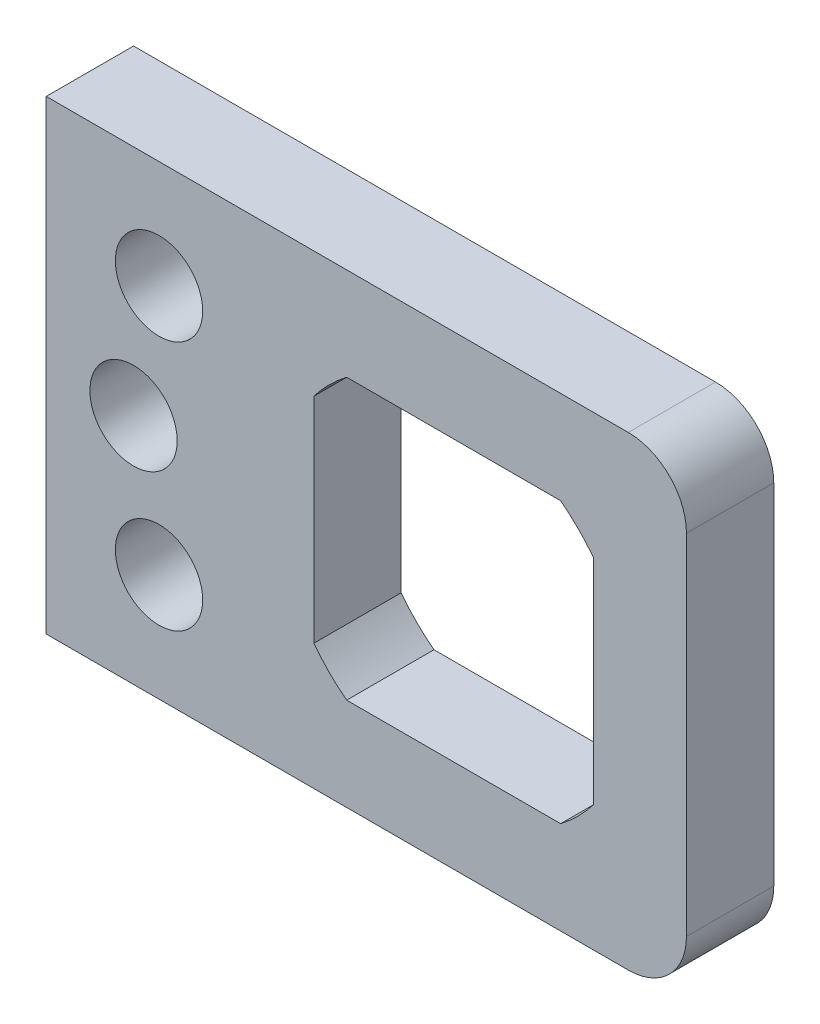
ISO-10303-21;
HEADER;
FILE_DESCRIPTION(('STEP AP214'),'2;1');
FILE_NAME('part.step','',(''),(''),'','','');
FILE_SCHEMA(('AUTOMOTIVE_DESIGN { 1 0 10303 214 1 1 1 1 }'));
ENDSEC;
DATA;
#1=APPLICATION_CONTEXT('core data for automotive mechanical design processes');
#2=APPLICATION_PROTOCOL_DEFINITION('international standard','automotive_design',2000,#1);
#3=PRODUCT_CONTEXT('',#1,'mechanical');
#4=PRODUCT('Part','Part','',(#3));
#5=PRODUCT_RELATED_PRODUCT_CATEGORY('part','',(#4));
#6=PRODUCT_DEFINITION_FORMATION('','',#4);
#7=PRODUCT_DEFINITION_CONTEXT('part definition',#1,'design');
#8=PRODUCT_DEFINITION('design','',#6,#7);
#9=PRODUCT_DEFINITION_SHAPE('','',#8);
#10=(LENGTH_UNIT() NAMED_UNIT(*) SI_UNIT(.MILLI.,.METRE.));
#11=(NAMED_UNIT(*) PLANE_ANGLE_UNIT() SI_UNIT($,.RADIAN.));
#12=(NAMED_UNIT(*) SI_UNIT($,.STERADIAN.) SOLID_ANGLE_UNIT());
#13=UNCERTAINTY_MEASURE_WITH_UNIT(LENGTH_MEASURE(1.E-05),#10,'distance_accuracy_value','');
#14=(GEOMETRIC_REPRESENTATION_CONTEXT(3) GLOBAL_UNCERTAINTY_ASSIGNED_CONTEXT((#13)) GLOBAL_UNIT_ASSIGNED_CONTEXT((#10,
#11,#12)) REPRESENTATION_CONTEXT('',''));
#15=CARTESIAN_POINT('',(0.,0.,0.));
#16=DIRECTION('',(0.,0.,1.));
#17=DIRECTION('',(1.,0.,0.));
#18=AXIS2_PLACEMENT_3D('',#15,#16,#17);
#19=CARTESIAN_POINT('',(0.,40.,15.));
#20=DIRECTION('',(0.,-1.,0.));
#21=DIRECTION('',(0.,0.,-1.));
#22=AXIS2_PLACEMENT_3D('',#19,#20,#21);
#23=PLANE('',#22);
#24=DIRECTION('',(-1.,0.,0.));
#25=VECTOR('',#24,1.);
#26=CARTESIAN_POINT('',(0.,40.,15.));
#27=LINE('',#26,#25);
#28=CARTESIAN_POINT('',(30.,40.,15.));
#29=VERTEX_POINT('',#28);
#30=CARTESIAN_POINT('',(-70.,40.,15.));
#31=VERTEX_POINT('',#30);
#32=EDGE_CURVE('E178',#29,#31,#27,.T.);
#33=ORIENTED_EDGE('',*,*,#32,.F.);
#34=DIRECTION('',(0.,0.,-1.));
#35=VECTOR('',#34,1.);
#36=CARTESIAN_POINT('',(30.,40.,0.));
#37=LINE('',#36,#35);
#38=CARTESIAN_POINT('',(30.,40.,0.));
#39=VERTEX_POINT('',#38);
#40=EDGE_CURVE('E11',#29,#39,#37,.T.);
#41=ORIENTED_EDGE('',*,*,#40,.T.);
#42=DIRECTION('',(-1.,0.,0.));
#43=VECTOR('',#42,1.);
#44=CARTESIAN_POINT('',(0.,40.,0.));
#45=LINE('',#44,#43);
#46=CARTESIAN_POINT('',(-70.,40.,0.));
#47=VERTEX_POINT('',#46);
#48=EDGE_CURVE('E205',#39,#47,#45,.T.);
#49=ORIENTED_EDGE('',*,*,#48,.T.);
#50=DIRECTION('',(0.,0.,-1.));
#51=VECTOR('',#50,1.);
#52=CARTESIAN_POINT('',(-70.,40.,15.));
#53=LINE('',#52,#51);
#54=EDGE_CURVE('E216',#31,#47,#53,.T.);
#55=ORIENTED_EDGE('',*,*,#54,.F.);
#56=EDGE_LOOP('',(#33,#41,#49,#55));
#57=FACE_BOUND('',#56,.T.);
#58=ADVANCED_FACE('F36',(#57),#23,.F.);
#59=CARTESIAN_POINT('',(-70.,0.,15.));
#60=DIRECTION('',(1.,0.,0.));
#61=DIRECTION('',(0.,0.,-1.));
#62=AXIS2_PLACEMENT_3D('',#59,#60,#61);
#63=PLANE('',#62);
#64=DIRECTION('',(0.,-1.,0.));
#65=VECTOR('',#64,1.);
#66=CARTESIAN_POINT('',(-70.,0.,0.));
#67=LINE('',#66,#65);
#68=CARTESIAN_POINT('',(-70.,-40.,0.));
#69=VERTEX_POINT('',#68);
#70=EDGE_CURVE('E207',#47,#69,#67,.T.);
#71=ORIENTED_EDGE('',*,*,#70,.T.);
#72=DIRECTION('',(0.,0.,-1.));
#73=VECTOR('',#72,1.);
#74=CARTESIAN_POINT('',(-70.,-40.,15.));
#75=LINE('',#74,#73);
#76=CARTESIAN_POINT('',(-70.,-40.,15.));
#77=VERTEX_POINT('',#76);
#78=EDGE_CURVE('E150',#77,#69,#75,.T.);
#79=ORIENTED_EDGE('',*,*,#78,.F.);
#80=DIRECTION('',(0.,-1.,0.));
#81=VECTOR('',#80,1.);
#82=CARTESIAN_POINT('',(-70.,0.,15.));
#83=LINE('',#82,#81);
#84=EDGE_CURVE('E180',#31,#77,#83,.T.);
#85=ORIENTED_EDGE('',*,*,#84,.F.);
#86=ORIENTED_EDGE('',*,*,#54,.T.);
#87=EDGE_LOOP('',(#71,#79,#85,#86));
#88=FACE_BOUND('',#87,.T.);
#89=ADVANCED_FACE('F256',(#88),#63,.F.);
#90=CARTESIAN_POINT('',(0.,-40.,15.));
#91=DIRECTION('',(0.,-1.,0.));
#92=DIRECTION('',(0.,0.,-1.));
#93=AXIS2_PLACEMENT_3D('',#90,#91,#92);
#94=PLANE('',#93);
#95=DIRECTION('',(-1.,0.,0.));
#96=VECTOR('',#95,1.);
#97=CARTESIAN_POINT('',(0.,-40.,0.));
#98=LINE('',#97,#96);
#99=CARTESIAN_POINT('',(30.,-40.,0.));
#100=VERTEX_POINT('',#99);
#101=EDGE_CURVE('E210',#100,#69,#98,.T.);
#102=ORIENTED_EDGE('',*,*,#101,.F.);
#103=DIRECTION('',(0.,0.,-1.));
#104=VECTOR('',#103,1.);
#105=CARTESIAN_POINT('',(30.,-40.,15.));
#106=LINE('',#105,#104);
#107=CARTESIAN_POINT('',(30.,-40.,15.));
#108=VERTEX_POINT('',#107);
#109=EDGE_CURVE('E59',#100,#108,#106,.F.);
#110=ORIENTED_EDGE('',*,*,#109,.T.);
#111=DIRECTION('',(-1.,0.,0.));
#112=VECTOR('',#111,1.);
#113=CARTESIAN_POINT('',(0.,-40.,15.));
#114=LINE('',#113,#112);
#115=EDGE_CURVE('E183',#108,#77,#114,.T.);
#116=ORIENTED_EDGE('',*,*,#115,.T.);
#117=ORIENTED_EDGE('',*,*,#78,.T.);
#118=EDGE_LOOP('',(#102,#110,#116,#117));
#119=FACE_BOUND('',#118,.T.);
#120=ADVANCED_FACE('F252',(#119),#94,.T.);
#121=CARTESIAN_POINT('',(0.,0.,15.));
#122=DIRECTION('',(0.,0.,-1.));
#123=DIRECTION('',(-1.,0.,0.));
#124=AXIS2_PLACEMENT_3D('',#121,#122,#123);
#125=CYLINDRICAL_SURFACE('',#124,30.25);
#126=CARTESIAN_POINT('',(0.,0.,0.));
#127=DIRECTION('',(0.,0.,1.));
#128=DIRECTION('',(1.,0.,0.));
#129=AXIS2_PLACEMENT_3D('',#126,#127,#128);
#130=CIRCLE('',#129,30.25);
#131=CARTESIAN_POINT('',(24.025,18.3810194222192,0.));
#132=VERTEX_POINT('',#131);
#133=CARTESIAN_POINT('',(18.3810194222192,24.025,0.));
#134=VERTEX_POINT('',#133);
#135=EDGE_CURVE('E145',#132,#134,#130,.T.);
#136=ORIENTED_EDGE('',*,*,#135,.F.);
#137=DIRECTION('',(0.,0.,-1.));
#138=VECTOR('',#137,1.);
#139=CARTESIAN_POINT('',(24.025,18.3810194222192,15.));
#140=LINE('',#139,#138);
#141=CARTESIAN_POINT('',(24.025,18.3810194222192,15.));
#142=VERTEX_POINT('',#141);
#143=EDGE_CURVE('E139',#142,#132,#140,.T.);
#144=ORIENTED_EDGE('',*,*,#143,.F.);
#145=CARTESIAN_POINT('',(0.,0.,15.));
#146=DIRECTION('',(0.,0.,1.));
#147=DIRECTION('',(1.,0.,0.));
#148=AXIS2_PLACEMENT_3D('',#145,#146,#147);
#149=CIRCLE('',#148,30.25);
#150=CARTESIAN_POINT('',(18.3810194222192,24.025,15.));
#151=VERTEX_POINT('',#150);
#152=EDGE_CURVE('E142',#142,#151,#149,.T.);
#153=ORIENTED_EDGE('',*,*,#152,.T.);
#154=DIRECTION('',(0.,0.,-1.));
#155=VECTOR('',#154,1.);
#156=CARTESIAN_POINT('',(18.3810194222192,24.025,15.));
#157=LINE('',#156,#155);
#158=EDGE_CURVE('E188',#151,#134,#157,.T.);
#159=ORIENTED_EDGE('',*,*,#158,.T.);
#160=EDGE_LOOP('',(#136,#144,#153,#159));
#161=FACE_BOUND('',#160,.T.);
#162=ADVANCED_FACE('F141',(#161),#125,.F.);
#163=CARTESIAN_POINT('',(24.025,0.,15.));
#164=DIRECTION('',(-1.,0.,0.));
#165=DIRECTION('',(0.,0.,1.));
#166=AXIS2_PLACEMENT_3D('',#163,#164,#165);
#167=PLANE('',#166);
#168=DIRECTION('',(0.,1.,0.));
#169=VECTOR('',#168,1.);
#170=CARTESIAN_POINT('',(24.025,0.,0.));
#171=LINE('',#170,#169);
#172=CARTESIAN_POINT('',(24.025,-18.3810194222192,0.));
#173=VERTEX_POINT('',#172);
#174=EDGE_CURVE('E190',#173,#132,#171,.T.);
#175=ORIENTED_EDGE('',*,*,#174,.F.);
#176=DIRECTION('',(0.,0.,-1.));
#177=VECTOR('',#176,1.);
#178=CARTESIAN_POINT('',(24.025,-18.3810194222192,15.));
#179=LINE('',#178,#177);
#180=CARTESIAN_POINT('',(24.025,-18.3810194222192,15.));
#181=VERTEX_POINT('',#180);
#182=EDGE_CURVE('E151',#181,#173,#179,.T.);
#183=ORIENTED_EDGE('',*,*,#182,.F.);
#184=DIRECTION('',(0.,1.,0.));
#185=VECTOR('',#184,1.);
#186=CARTESIAN_POINT('',(24.025,0.,15.));
#187=LINE('',#186,#185);
#188=EDGE_CURVE('E157',#181,#142,#187,.T.);
#189=ORIENTED_EDGE('',*,*,#188,.T.);
#190=ORIENTED_EDGE('',*,*,#143,.T.);
#191=EDGE_LOOP('',(#175,#183,#189,#190));
#192=FACE_BOUND('',#191,.T.);
#193=ADVANCED_FACE('F166',(#192),#167,.T.);
#194=CARTESIAN_POINT('',(18.3810194222192,-24.025,0.));
#195=VERTEX_POINT('',#194);
#196=EDGE_CURVE('E193',#195,#173,#130,.T.);
#197=ORIENTED_EDGE('',*,*,#196,.F.);
#198=DIRECTION('',(0.,0.,-1.));
#199=VECTOR('',#198,1.);
#200=CARTESIAN_POINT('',(18.3810194222192,-24.025,15.));
#201=LINE('',#200,#199);
#202=CARTESIAN_POINT('',(18.3810194222192,-24.025,15.));
#203=VERTEX_POINT('',#202);
#204=EDGE_CURVE('E229',#203,#195,#201,.T.);
#205=ORIENTED_EDGE('',*,*,#204,.F.);
#206=EDGE_CURVE('E165',#203,#181,#149,.T.);
#207=ORIENTED_EDGE('',*,*,#206,.T.);
#208=ORIENTED_EDGE('',*,*,#182,.T.);
#209=EDGE_LOOP('',(#197,#205,#207,#208));
#210=FACE_BOUND('',#209,.T.);
#211=ADVANCED_FACE('F291',(#210),#125,.F.);
#212=CARTESIAN_POINT('',(0.,-24.025,15.));
#213=DIRECTION('',(0.,1.,0.));
#214=DIRECTION('',(0.,0.,1.));
#215=AXIS2_PLACEMENT_3D('',#212,#213,#214);
#216=PLANE('',#215);
#217=DIRECTION('',(1.,0.,0.));
#218=VECTOR('',#217,1.);
#219=CARTESIAN_POINT('',(0.,-24.025,0.));
#220=LINE('',#219,#218);
#221=CARTESIAN_POINT('',(-18.3810194222192,-24.025,0.));
#222=VERTEX_POINT('',#221);
#223=EDGE_CURVE('E195',#222,#195,#220,.T.);
#224=ORIENTED_EDGE('',*,*,#223,.F.);
#225=DIRECTION('',(0.,0.,-1.));
#226=VECTOR('',#225,1.);
#227=CARTESIAN_POINT('',(-18.3810194222192,-24.025,15.));
#228=LINE('',#227,#226);
#229=CARTESIAN_POINT('',(-18.3810194222192,-24.025,15.));
#230=VERTEX_POINT('',#229);
#231=EDGE_CURVE('E227',#230,#222,#228,.T.);
#232=ORIENTED_EDGE('',*,*,#231,.F.);
#233=DIRECTION('',(1.,0.,0.));
#234=VECTOR('',#233,1.);
#235=CARTESIAN_POINT('',(0.,-24.025,15.));
#236=LINE('',#235,#234);
#237=EDGE_CURVE('E168',#230,#203,#236,.T.);
#238=ORIENTED_EDGE('',*,*,#237,.T.);
#239=ORIENTED_EDGE('',*,*,#204,.T.);
#240=EDGE_LOOP('',(#224,#232,#238,#239));
#241=FACE_BOUND('',#240,.T.);
#242=ADVANCED_FACE('F288',(#241),#216,.T.);
#243=CARTESIAN_POINT('',(-24.025,-18.3810194222192,0.));
#244=VERTEX_POINT('',#243);
#245=EDGE_CURVE('E198',#244,#222,#130,.T.);
#246=ORIENTED_EDGE('',*,*,#245,.F.);
#247=DIRECTION('',(0.,0.,-1.));
#248=VECTOR('',#247,1.);
#249=CARTESIAN_POINT('',(-24.025,-18.3810194222192,15.));
#250=LINE('',#249,#248);
#251=CARTESIAN_POINT('',(-24.025,-18.3810194222192,15.));
#252=VERTEX_POINT('',#251);
#253=EDGE_CURVE('E225',#252,#244,#250,.T.);
#254=ORIENTED_EDGE('',*,*,#253,.F.);
#255=EDGE_CURVE('E169',#252,#230,#149,.T.);
#256=ORIENTED_EDGE('',*,*,#255,.T.);
#257=ORIENTED_EDGE('',*,*,#231,.T.);
#258=EDGE_LOOP('',(#246,#254,#256,#257));
#259=FACE_BOUND('',#258,.T.);
#260=ADVANCED_FACE('F284',(#259),#125,.F.);
#261=CARTESIAN_POINT('',(-24.025,0.,15.));
#262=DIRECTION('',(1.,0.,0.));
#263=DIRECTION('',(0.,0.,-1.));
#264=AXIS2_PLACEMENT_3D('',#261,#262,#263);
#265=PLANE('',#264);
#266=DIRECTION('',(0.,-1.,0.));
#267=VECTOR('',#266,1.);
#268=CARTESIAN_POINT('',(-24.025,0.,0.));
#269=LINE('',#268,#267);
#270=CARTESIAN_POINT('',(-24.025,18.3810194222192,0.));
#271=VERTEX_POINT('',#270);
#272=EDGE_CURVE('E199',#271,#244,#269,.T.);
#273=ORIENTED_EDGE('',*,*,#272,.F.);
#274=DIRECTION('',(0.,0.,-1.));
#275=VECTOR('',#274,1.);
#276=CARTESIAN_POINT('',(-24.025,18.3810194222192,15.));
#277=LINE('',#276,#275);
#278=CARTESIAN_POINT('',(-24.025,18.3810194222192,15.));
#279=VERTEX_POINT('',#278);
#280=EDGE_CURVE('E223',#279,#271,#277,.T.);
#281=ORIENTED_EDGE('',*,*,#280,.F.);
#282=DIRECTION('',(0.,-1.,0.));
#283=VECTOR('',#282,1.);
#284=CARTESIAN_POINT('',(-24.025,0.,15.));
#285=LINE('',#284,#283);
#286=EDGE_CURVE('E174',#279,#252,#285,.T.);
#287=ORIENTED_EDGE('',*,*,#286,.T.);
#288=ORIENTED_EDGE('',*,*,#253,.T.);
#289=EDGE_LOOP('',(#273,#281,#287,#288));
#290=FACE_BOUND('',#289,.T.);
#291=ADVANCED_FACE('F282',(#290),#265,.T.);
#292=CARTESIAN_POINT('',(-18.3810194222192,24.025,0.));
#293=VERTEX_POINT('',#292);
#294=EDGE_CURVE('E192',#293,#271,#130,.T.);
#295=ORIENTED_EDGE('',*,*,#294,.F.);
#296=DIRECTION('',(0.,0.,-1.));
#297=VECTOR('',#296,1.);
#298=CARTESIAN_POINT('',(-18.3810194222192,24.025,15.));
#299=LINE('',#298,#297);
#300=CARTESIAN_POINT('',(-18.3810194222192,24.025,15.));
#301=VERTEX_POINT('',#300);
#302=EDGE_CURVE('E221',#301,#293,#299,.T.);
#303=ORIENTED_EDGE('',*,*,#302,.F.);
#304=EDGE_CURVE('E164',#301,#279,#149,.T.);
#305=ORIENTED_EDGE('',*,*,#304,.T.);
#306=ORIENTED_EDGE('',*,*,#280,.T.);
#307=EDGE_LOOP('',(#295,#303,#305,#306));
#308=FACE_BOUND('',#307,.T.);
#309=ADVANCED_FACE('F278',(#308),#125,.F.);
#310=CARTESIAN_POINT('',(0.,24.025,15.));
#311=DIRECTION('',(0.,-1.,0.));
#312=DIRECTION('',(0.,0.,-1.));
#313=AXIS2_PLACEMENT_3D('',#310,#311,#312);
#314=PLANE('',#313);
#315=DIRECTION('',(-1.,0.,0.));
#316=VECTOR('',#315,1.);
#317=CARTESIAN_POINT('',(0.,24.025,0.));
#318=LINE('',#317,#316);
#319=EDGE_CURVE('E202',#134,#293,#318,.T.);
#320=ORIENTED_EDGE('',*,*,#319,.F.);
#321=ORIENTED_EDGE('',*,*,#158,.F.);
#322=DIRECTION('',(-1.,0.,0.));
#323=VECTOR('',#322,1.);
#324=CARTESIAN_POINT('',(0.,24.025,15.));
#325=LINE('',#324,#323);
#326=EDGE_CURVE('E161',#151,#301,#325,.T.);
#327=ORIENTED_EDGE('',*,*,#326,.T.);
#328=ORIENTED_EDGE('',*,*,#302,.T.);
#329=EDGE_LOOP('',(#320,#321,#327,#328));
#330=FACE_BOUND('',#329,.T.);
#331=ADVANCED_FACE('F275',(#330),#314,.T.);
#332=CARTESIAN_POINT('',(40.,0.,15.));
#333=DIRECTION('',(1.,0.,0.));
#334=DIRECTION('',(0.,1.,0.));
#335=AXIS2_PLACEMENT_3D('',#332,#333,#334);
#336=PLANE('',#335);
#337=DIRECTION('',(0.,-1.,0.));
#338=VECTOR('',#337,1.);
#339=CARTESIAN_POINT('',(40.,0.,15.));
#340=LINE('',#339,#338);
#341=CARTESIAN_POINT('',(40.,30.,15.));
#342=VERTEX_POINT('',#341);
#343=CARTESIAN_POINT('',(40.,-30.,15.));
#344=VERTEX_POINT('',#343);
#345=EDGE_CURVE('E185',#342,#344,#340,.T.);
#346=ORIENTED_EDGE('',*,*,#345,.T.);
#347=DIRECTION('',(0.,0.,-1.));
#348=VECTOR('',#347,1.);
#349=CARTESIAN_POINT('',(40.,-30.,15.));
#350=LINE('',#349,#348);
#351=CARTESIAN_POINT('',(40.,-30.,0.));
#352=VERTEX_POINT('',#351);
#353=EDGE_CURVE('E233',#344,#352,#350,.T.);
#354=ORIENTED_EDGE('',*,*,#353,.T.);
#355=DIRECTION('',(0.,-1.,0.));
#356=VECTOR('',#355,1.);
#357=CARTESIAN_POINT('',(40.,0.,0.));
#358=LINE('',#357,#356);
#359=CARTESIAN_POINT('',(40.,30.,0.));
#360=VERTEX_POINT('',#359);
#361=EDGE_CURVE('E162',#360,#352,#358,.T.);
#362=ORIENTED_EDGE('',*,*,#361,.F.);
#363=DIRECTION('',(0.,0.,-1.));
#364=VECTOR('',#363,1.);
#365=CARTESIAN_POINT('',(40.,30.,15.));
#366=LINE('',#365,#364);
#367=EDGE_CURVE('E219',#360,#342,#366,.F.);
#368=ORIENTED_EDGE('',*,*,#367,.T.);
#369=EDGE_LOOP('',(#346,#354,#362,#368));
#370=FACE_BOUND('',#369,.T.);
#371=ADVANCED_FACE('F245',(#370),#336,.T.);
#372=CARTESIAN_POINT('',(0.,0.,15.));
#373=DIRECTION('',(0.,0.,1.));
#374=DIRECTION('',(1.,0.,0.));
#375=AXIS2_PLACEMENT_3D('',#372,#373,#374);
#376=PLANE('',#375);
#377=CARTESIAN_POINT('',(-55.,0.,15.));
#378=DIRECTION('',(0.,0.,1.));
#379=DIRECTION('',(1.,0.,0.));
#380=AXIS2_PLACEMENT_3D('',#377,#378,#379);
#381=CIRCLE('',#380,7.50000000000001);
#382=CARTESIAN_POINT('',(-47.5,0.,15.));
#383=VERTEX_POINT('',#382);
#384=EDGE_CURVE('E328',#383,#383,#381,.T.);
#385=ORIENTED_EDGE('',*,*,#384,.F.);
#386=EDGE_LOOP('',(#385));
#387=FACE_BOUND('',#386,.T.);
#388=CARTESIAN_POINT('',(-50.6236110920586,21.5,15.));
#389=DIRECTION('',(0.,0.,1.));
#390=DIRECTION('',(1.,0.,0.));
#391=AXIS2_PLACEMENT_3D('',#388,#389,#390);
#392=CIRCLE('',#391,7.50000000000001);
#393=CARTESIAN_POINT('',(-43.1236110920586,21.5,15.));
#394=VERTEX_POINT('',#393);
#395=EDGE_CURVE('E332',#394,#394,#392,.T.);
#396=ORIENTED_EDGE('',*,*,#395,.F.);
#397=EDGE_LOOP('',(#396));
#398=FACE_BOUND('',#397,.T.);
#399=CARTESIAN_POINT('',(-50.6236110920586,-21.5,15.));
#400=DIRECTION('',(0.,0.,1.));
#401=DIRECTION('',(1.,0.,0.));
#402=AXIS2_PLACEMENT_3D('',#399,#400,#401);
#403=CIRCLE('',#402,7.50000000000001);
#404=CARTESIAN_POINT('',(-43.1236110920586,-21.5,15.));
#405=VERTEX_POINT('',#404);
#406=EDGE_CURVE('E341',#405,#405,#403,.T.);
#407=ORIENTED_EDGE('',*,*,#406,.F.);
#408=EDGE_LOOP('',(#407));
#409=FACE_BOUND('',#408,.T.);
#410=ORIENTED_EDGE('',*,*,#152,.F.);
#411=ORIENTED_EDGE('',*,*,#188,.F.);
#412=ORIENTED_EDGE('',*,*,#206,.F.);
#413=ORIENTED_EDGE('',*,*,#237,.F.);
#414=ORIENTED_EDGE('',*,*,#255,.F.);
#415=ORIENTED_EDGE('',*,*,#286,.F.);
#416=ORIENTED_EDGE('',*,*,#304,.F.);
#417=ORIENTED_EDGE('',*,*,#326,.F.);
#418=EDGE_LOOP('',(#410,#411,#412,#413,#414,#415,#416,#417));
#419=FACE_BOUND('',#418,.T.);
#420=ORIENTED_EDGE('',*,*,#115,.F.);
#421=CARTESIAN_POINT('',(30.,-30.,15.));
#422=DIRECTION('',(0.,0.,1.));
#423=DIRECTION('',(1.,0.,0.));
#424=AXIS2_PLACEMENT_3D('',#421,#422,#423);
#425=CIRCLE('',#424,10.);
#426=EDGE_CURVE('E44',#108,#344,#425,.T.);
#427=ORIENTED_EDGE('',*,*,#426,.T.);
#428=ORIENTED_EDGE('',*,*,#345,.F.);
#429=CARTESIAN_POINT('',(30.,30.,15.));
#430=DIRECTION('',(0.,0.,1.));
#431=DIRECTION('',(1.,0.,0.));
#432=AXIS2_PLACEMENT_3D('',#429,#430,#431);
#433=CIRCLE('',#432,10.);
#434=EDGE_CURVE('E51',#342,#29,#433,.T.);
#435=ORIENTED_EDGE('',*,*,#434,.T.);
#436=ORIENTED_EDGE('',*,*,#32,.T.);
#437=ORIENTED_EDGE('',*,*,#84,.T.);
#438=EDGE_LOOP('',(#420,#427,#428,#435,#436,#437));
#439=FACE_BOUND('',#438,.T.);
#440=ADVANCED_FACE('F155',(#387,#398,#409,#419,#439),#376,.T.);
#441=CARTESIAN_POINT('',(0.,0.,0.));
#442=DIRECTION('',(0.,0.,1.));
#443=DIRECTION('',(1.,0.,0.));
#444=AXIS2_PLACEMENT_3D('',#441,#442,#443);
#445=PLANE('',#444);
#446=CARTESIAN_POINT('',(-55.,0.,0.));
#447=DIRECTION('',(0.,0.,1.));
#448=DIRECTION('',(1.,0.,0.));
#449=AXIS2_PLACEMENT_3D('',#446,#447,#448);
#450=CIRCLE('',#449,7.50000000000001);
#451=CARTESIAN_POINT('',(-47.5,0.,0.));
#452=VERTEX_POINT('',#451);
#453=EDGE_CURVE('E331',#452,#452,#450,.F.);
#454=ORIENTED_EDGE('',*,*,#453,.F.);
#455=EDGE_LOOP('',(#454));
#456=FACE_BOUND('',#455,.T.);
#457=CARTESIAN_POINT('',(-50.6236110920586,21.5,0.));
#458=DIRECTION('',(0.,0.,1.));
#459=DIRECTION('',(1.,0.,0.));
#460=AXIS2_PLACEMENT_3D('',#457,#458,#459);
#461=CIRCLE('',#460,7.50000000000001);
#462=CARTESIAN_POINT('',(-43.1236110920586,21.5,0.));
#463=VERTEX_POINT('',#462);
#464=EDGE_CURVE('E335',#463,#463,#461,.F.);
#465=ORIENTED_EDGE('',*,*,#464,.F.);
#466=EDGE_LOOP('',(#465));
#467=FACE_BOUND('',#466,.T.);
#468=CARTESIAN_POINT('',(-50.6236110920586,-21.5,0.));
#469=DIRECTION('',(0.,0.,1.));
#470=DIRECTION('',(1.,0.,0.));
#471=AXIS2_PLACEMENT_3D('',#468,#469,#470);
#472=CIRCLE('',#471,7.50000000000001);
#473=CARTESIAN_POINT('',(-43.1236110920586,-21.5,0.));
#474=VERTEX_POINT('',#473);
#475=EDGE_CURVE('E191',#474,#474,#472,.F.);
#476=ORIENTED_EDGE('',*,*,#475,.F.);
#477=EDGE_LOOP('',(#476));
#478=FACE_BOUND('',#477,.T.);
#479=ORIENTED_EDGE('',*,*,#135,.T.);
#480=ORIENTED_EDGE('',*,*,#319,.T.);
#481=ORIENTED_EDGE('',*,*,#294,.T.);
#482=ORIENTED_EDGE('',*,*,#272,.T.);
#483=ORIENTED_EDGE('',*,*,#245,.T.);
#484=ORIENTED_EDGE('',*,*,#223,.T.);
#485=ORIENTED_EDGE('',*,*,#196,.T.);
#486=ORIENTED_EDGE('',*,*,#174,.T.);
#487=EDGE_LOOP('',(#479,#480,#481,#482,#483,#484,#485,#486));
#488=FACE_BOUND('',#487,.T.);
#489=ORIENTED_EDGE('',*,*,#361,.T.);
#490=CARTESIAN_POINT('',(30.,-30.,0.));
#491=DIRECTION('',(0.,0.,1.));
#492=DIRECTION('',(1.,0.,0.));
#493=AXIS2_PLACEMENT_3D('',#490,#491,#492);
#494=CIRCLE('',#493,10.);
#495=EDGE_CURVE('E238',#352,#100,#494,.F.);
#496=ORIENTED_EDGE('',*,*,#495,.T.);
#497=ORIENTED_EDGE('',*,*,#101,.T.);
#498=ORIENTED_EDGE('',*,*,#70,.F.);
#499=ORIENTED_EDGE('',*,*,#48,.F.);
#500=CARTESIAN_POINT('',(30.,30.,0.));
#501=DIRECTION('',(0.,0.,1.));
#502=DIRECTION('',(1.,0.,0.));
#503=AXIS2_PLACEMENT_3D('',#500,#501,#502);
#504=CIRCLE('',#503,10.);
#505=EDGE_CURVE('E236',#39,#360,#504,.F.);
#506=ORIENTED_EDGE('',*,*,#505,.T.);
#507=EDGE_LOOP('',(#489,#496,#497,#498,#499,#506));
#508=FACE_BOUND('',#507,.T.);
#509=ADVANCED_FACE('F250',(#456,#467,#478,#488,#508),#445,.F.);
#510=CARTESIAN_POINT('',(-50.6236110920586,-21.5,-15.001));
#511=DIRECTION('',(0.,0.,1.));
#512=DIRECTION('',(1.,0.,0.));
#513=AXIS2_PLACEMENT_3D('',#510,#511,#512);
#514=CYLINDRICAL_SURFACE('',#513,7.50000000000001);
#515=ORIENTED_EDGE('',*,*,#406,.T.);
#516=EDGE_LOOP('',(#515));
#517=FACE_BOUND('',#516,.T.);
#518=ORIENTED_EDGE('',*,*,#475,.T.);
#519=EDGE_LOOP('',(#518));
#520=FACE_BOUND('',#519,.T.);
#521=ADVANCED_FACE('F309',(#517,#520),#514,.F.);
#522=CARTESIAN_POINT('',(-50.6236110920586,21.5,-15.001));
#523=DIRECTION('',(0.,0.,1.));
#524=DIRECTION('',(1.,0.,0.));
#525=AXIS2_PLACEMENT_3D('',#522,#523,#524);
#526=CYLINDRICAL_SURFACE('',#525,7.50000000000001);
#527=ORIENTED_EDGE('',*,*,#395,.T.);
#528=EDGE_LOOP('',(#527));
#529=FACE_BOUND('',#528,.T.);
#530=ORIENTED_EDGE('',*,*,#464,.T.);
#531=EDGE_LOOP('',(#530));
#532=FACE_BOUND('',#531,.T.);
#533=ADVANCED_FACE('F316',(#529,#532),#526,.F.);
#534=CARTESIAN_POINT('',(-55.,0.,-15.001));
#535=DIRECTION('',(0.,0.,1.));
#536=DIRECTION('',(1.,0.,0.));
#537=AXIS2_PLACEMENT_3D('',#534,#535,#536);
#538=CYLINDRICAL_SURFACE('',#537,7.50000000000001);
#539=ORIENTED_EDGE('',*,*,#384,.T.);
#540=EDGE_LOOP('',(#539));
#541=FACE_BOUND('',#540,.T.);
#542=ORIENTED_EDGE('',*,*,#453,.T.);
#543=EDGE_LOOP('',(#542));
#544=FACE_BOUND('',#543,.T.);
#545=ADVANCED_FACE('F266',(#541,#544),#538,.F.);
#546=CARTESIAN_POINT('',(30.,-30.,15.));
#547=DIRECTION('',(0.,0.,-1.));
#548=DIRECTION('',(-1.,0.,0.));
#549=AXIS2_PLACEMENT_3D('',#546,#547,#548);
#550=CYLINDRICAL_SURFACE('',#549,10.);
#551=ORIENTED_EDGE('',*,*,#426,.F.);
#552=ORIENTED_EDGE('',*,*,#109,.F.);
#553=ORIENTED_EDGE('',*,*,#495,.F.);
#554=ORIENTED_EDGE('',*,*,#353,.F.);
#555=EDGE_LOOP('',(#551,#552,#553,#554));
#556=FACE_BOUND('',#555,.T.);
#557=ADVANCED_FACE('F248',(#556),#550,.T.);
#558=CARTESIAN_POINT('',(30.,30.,15.));
#559=DIRECTION('',(0.,0.,1.));
#560=DIRECTION('',(1.,0.,0.));
#561=AXIS2_PLACEMENT_3D('',#558,#559,#560);
#562=CYLINDRICAL_SURFACE('',#561,10.);
#563=ORIENTED_EDGE('',*,*,#434,.F.);
#564=ORIENTED_EDGE('',*,*,#367,.F.);
#565=ORIENTED_EDGE('',*,*,#505,.F.);
#566=ORIENTED_EDGE('',*,*,#40,.F.);
#567=EDGE_LOOP('',(#563,#564,#565,#566));
#568=FACE_BOUND('',#567,.T.);
#569=ADVANCED_FACE('F38',(#568),#562,.T.);
#570=CLOSED_SHELL('',(#58,#89,#120,#162,#193,#211,#242,#260,#291,#309,#331,#371,#440,#509,#521,
#533,#545,#557,#569));
#571=MANIFOLD_SOLID_BREP('B2',#570);
#572=ADVANCED_BREP_SHAPE_REPRESENTATION('',(#18,#571),#14);
#573=SHAPE_DEFINITION_REPRESENTATION(#9,#572);
ENDSEC;
END-ISO-10303-21;
